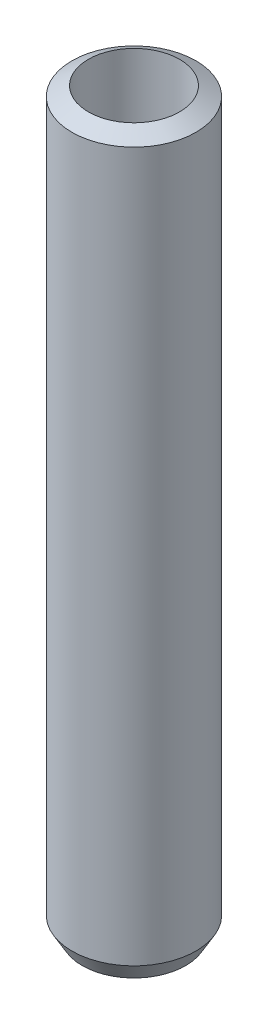
ISO-10303-21;
HEADER;
FILE_DESCRIPTION(('STEP AP214'),'2;1');
FILE_NAME('part.step','',(''),(''),'','','');
FILE_SCHEMA(('AUTOMOTIVE_DESIGN { 1 0 10303 214 1 1 1 1 }'));
ENDSEC;
DATA;
#1=APPLICATION_CONTEXT('core data for automotive mechanical design processes');
#2=APPLICATION_PROTOCOL_DEFINITION('international standard','automotive_design',2000,#1);
#3=PRODUCT_CONTEXT('',#1,'mechanical');
#4=PRODUCT('Part','Part','',(#3));
#5=PRODUCT_RELATED_PRODUCT_CATEGORY('part','',(#4));
#6=PRODUCT_DEFINITION_FORMATION('','',#4);
#7=PRODUCT_DEFINITION_CONTEXT('part definition',#1,'design');
#8=PRODUCT_DEFINITION('design','',#6,#7);
#9=PRODUCT_DEFINITION_SHAPE('','',#8);
#10=(LENGTH_UNIT() NAMED_UNIT(*) SI_UNIT(.MILLI.,.METRE.));
#11=(NAMED_UNIT(*) PLANE_ANGLE_UNIT() SI_UNIT($,.RADIAN.));
#12=(NAMED_UNIT(*) SI_UNIT($,.STERADIAN.) SOLID_ANGLE_UNIT());
#13=UNCERTAINTY_MEASURE_WITH_UNIT(LENGTH_MEASURE(1.E-05),#10,'distance_accuracy_value','');
#14=(GEOMETRIC_REPRESENTATION_CONTEXT(3) GLOBAL_UNCERTAINTY_ASSIGNED_CONTEXT((#13)) GLOBAL_UNIT_ASSIGNED_CONTEXT((#10,
#11,#12)) REPRESENTATION_CONTEXT('',''));
#15=CARTESIAN_POINT('',(0.,0.,0.));
#16=DIRECTION('',(0.,0.,1.));
#17=DIRECTION('',(1.,0.,0.));
#18=AXIS2_PLACEMENT_3D('',#15,#16,#17);
#19=CARTESIAN_POINT('',(0.,148.592827271431,0.));
#20=DIRECTION('',(0.,-1.,0.));
#21=DIRECTION('',(0.,0.,-1.));
#22=AXIS2_PLACEMENT_3D('',#19,#20,#21);
#23=CYLINDRICAL_SURFACE('',#22,12.5);
#24=CARTESIAN_POINT('',(0.,146.523268225024,0.));
#25=DIRECTION('',(0.,1.,0.));
#26=DIRECTION('',(0.,0.,1.));
#27=AXIS2_PLACEMENT_3D('',#24,#25,#26);
#28=CIRCLE('',#27,12.5);
#29=CARTESIAN_POINT('',(0.,146.523268225024,12.5));
#30=VERTEX_POINT('',#29);
#31=EDGE_CURVE('E50',#30,#30,#28,.F.);
#32=ORIENTED_EDGE('',*,*,#31,.T.);
#33=EDGE_LOOP('',(#32));
#34=FACE_BOUND('',#33,.T.);
#35=CARTESIAN_POINT('',(0.,3.58458141763965,0.));
#36=DIRECTION('',(0.,1.,0.));
#37=DIRECTION('',(0.,0.,1.));
#38=AXIS2_PLACEMENT_3D('',#35,#36,#37);
#39=CIRCLE('',#38,12.5);
#40=CARTESIAN_POINT('',(0.,3.58458141763965,12.5));
#41=VERTEX_POINT('',#40);
#42=EDGE_CURVE('E51',#41,#41,#39,.T.);
#43=ORIENTED_EDGE('',*,*,#42,.T.);
#44=EDGE_LOOP('',(#43));
#45=FACE_BOUND('',#44,.T.);
#46=ADVANCED_FACE('F39',(#34,#45),#23,.T.);
#47=CARTESIAN_POINT('',(0.,0.,0.));
#48=DIRECTION('',(0.,1.,0.));
#49=DIRECTION('',(0.,0.,1.));
#50=AXIS2_PLACEMENT_3D('',#47,#48,#49);
#51=PLANE('',#50);
#52=CARTESIAN_POINT('',(0.,0.,0.));
#53=DIRECTION('',(0.,1.,0.));
#54=DIRECTION('',(0.,0.,1.));
#55=AXIS2_PLACEMENT_3D('',#52,#53,#54);
#56=CIRCLE('',#55,10.4304409535936);
#57=CARTESIAN_POINT('',(0.,0.,10.4304409535936));
#58=VERTEX_POINT('',#57);
#59=EDGE_CURVE('E10',#58,#58,#56,.F.);
#60=ORIENTED_EDGE('',*,*,#59,.T.);
#61=EDGE_LOOP('',(#60));
#62=FACE_BOUND('',#61,.T.);
#63=CARTESIAN_POINT('',(0.,0.,0.));
#64=DIRECTION('',(0.,1.,0.));
#65=DIRECTION('',(0.,0.,1.));
#66=AXIS2_PLACEMENT_3D('',#63,#64,#65);
#67=CIRCLE('',#66,9.19227591089317);
#68=CARTESIAN_POINT('',(0.,0.,9.19227591089317));
#69=VERTEX_POINT('',#68);
#70=EDGE_CURVE('E58',#69,#69,#67,.T.);
#71=ORIENTED_EDGE('',*,*,#70,.T.);
#72=EDGE_LOOP('',(#71));
#73=FACE_BOUND('',#72,.T.);
#74=ADVANCED_FACE('F62',(#62,#73),#51,.F.);
#75=CARTESIAN_POINT('',(0.,148.592827271431,0.));
#76=DIRECTION('',(0.,-1.,0.));
#77=DIRECTION('',(0.,0.,-1.));
#78=AXIS2_PLACEMENT_3D('',#75,#76,#77);
#79=CYLINDRICAL_SURFACE('',#78,9.19227591089317);
#80=CARTESIAN_POINT('',(0.,148.432983618275,0.));
#81=DIRECTION('',(0.,-1.,0.));
#82=DIRECTION('',(0.,0.,-1.));
#83=AXIS2_PLACEMENT_3D('',#80,#81,#82);
#84=CIRCLE('',#83,9.19227591089317);
#85=CARTESIAN_POINT('',(0.,148.432983618275,-9.19227591089317));
#86=VERTEX_POINT('',#85);
#87=EDGE_CURVE('E54',#86,#86,#84,.F.);
#88=ORIENTED_EDGE('',*,*,#87,.T.);
#89=EDGE_LOOP('',(#88));
#90=FACE_BOUND('',#89,.T.);
#91=ORIENTED_EDGE('',*,*,#70,.F.);
#92=EDGE_LOOP('',(#91));
#93=FACE_BOUND('',#92,.T.);
#94=ADVANCED_FACE('F68',(#90,#93),#79,.F.);
#95=CARTESIAN_POINT('',(0.,148.592827271431,0.));
#96=DIRECTION('',(0.,-1.,0.));
#97=DIRECTION('',(0.,0.,-1.));
#98=AXIS2_PLACEMENT_3D('',#95,#96,#97);
#99=CONICAL_SURFACE('',#98,8.91541858236034,1.0471975511966);
#100=ORIENTED_EDGE('',*,*,#31,.F.);
#101=EDGE_LOOP('',(#100));
#102=FACE_BOUND('',#101,.T.);
#103=ORIENTED_EDGE('',*,*,#87,.F.);
#104=EDGE_LOOP('',(#103));
#105=FACE_BOUND('',#104,.T.);
#106=ADVANCED_FACE('F66',(#102,#105),#99,.T.);
#107=CARTESIAN_POINT('',(0.,3.58458141763965,0.));
#108=DIRECTION('',(0.,1.,0.));
#109=DIRECTION('',(0.,0.,1.));
#110=AXIS2_PLACEMENT_3D('',#107,#108,#109);
#111=CONICAL_SURFACE('',#110,12.5,0.523598775598304);
#112=CARTESIAN_POINT('',(0.,0.,10.4304409535936));
#113=CARTESIAN_POINT('',(0.,0.0373393897670794,10.451998860327));
#114=CARTESIAN_POINT('',(0.,0.0746787795341591,10.4735567670604));
#115=CARTESIAN_POINT('',(0.,0.149357559068318,10.5166725805272));
#116=CARTESIAN_POINT('',(0.,0.186696948835398,10.5382304872606));
#117=CARTESIAN_POINT('',(0.,0.261375728369557,10.5813463007274));
#118=CARTESIAN_POINT('',(0.,0.298715118136637,10.6029042074608));
#119=CARTESIAN_POINT('',(0.,0.373393897670796,10.6460200209276));
#120=CARTESIAN_POINT('',(0.,0.410733287437876,10.667577927661));
#121=CARTESIAN_POINT('',(0.,0.485412066972035,10.7106937411278));
#122=CARTESIAN_POINT('',(0.,0.522751456739115,10.7322516478612));
#123=CARTESIAN_POINT('',(0.,0.597430236273274,10.775367461328));
#124=CARTESIAN_POINT('',(0.,0.634769626040354,10.7969253680614));
#125=CARTESIAN_POINT('',(0.,0.709448405574513,10.8400411815282));
#126=CARTESIAN_POINT('',(0.,0.746787795341593,10.8615990882616));
#127=CARTESIAN_POINT('',(0.,0.821466574875752,10.9047149017284));
#128=CARTESIAN_POINT('',(0.,0.858805964642832,10.9262728084618));
#129=CARTESIAN_POINT('',(0.,0.933484744176991,10.9693886219286));
#130=CARTESIAN_POINT('',(0.,0.970824133944071,10.990946528662));
#131=CARTESIAN_POINT('',(0.,1.04550291347823,11.0340623421288));
#132=CARTESIAN_POINT('',(0.,1.08284230324531,11.0556202488622));
#133=CARTESIAN_POINT('',(0.,1.15752108277947,11.098736062329));
#134=CARTESIAN_POINT('',(0.,1.19486047254655,11.1202939690624));
#135=CARTESIAN_POINT('',(0.,1.26953925208071,11.1634097825292));
#136=CARTESIAN_POINT('',(0.,1.30687864184779,11.1849676892626));
#137=CARTESIAN_POINT('',(0.,1.38155742138195,11.2280835027294));
#138=CARTESIAN_POINT('',(0.,1.41889681114903,11.2496414094628));
#139=CARTESIAN_POINT('',(0.,1.49357559068319,11.2927572229296));
#140=CARTESIAN_POINT('',(0.,1.53091498045027,11.314315129663));
#141=CARTESIAN_POINT('',(0.,1.60559375998443,11.3574309431298));
#142=CARTESIAN_POINT('',(0.,1.64293314975151,11.3789888498632));
#143=CARTESIAN_POINT('',(0.,1.71761192928566,11.42210466333));
#144=CARTESIAN_POINT('',(0.,1.75495131905274,11.4436625700634));
#145=CARTESIAN_POINT('',(0.,1.8296300985869,11.4867783835302));
#146=CARTESIAN_POINT('',(0.,1.86696948835398,11.5083362902636));
#147=CARTESIAN_POINT('',(0.,1.94164826788814,11.5514521037304));
#148=CARTESIAN_POINT('',(0.,1.97898765765522,11.5730100104638));
#149=CARTESIAN_POINT('',(0.,2.05366643718938,11.6161258239306));
#150=CARTESIAN_POINT('',(0.,2.09100582695646,11.637683730664));
#151=CARTESIAN_POINT('',(0.,2.16568460649062,11.6807995441308));
#152=CARTESIAN_POINT('',(0.,2.2030239962577,11.7023574508642));
#153=CARTESIAN_POINT('',(0.,2.27770277579186,11.745473264331));
#154=CARTESIAN_POINT('',(0.,2.31504216555894,11.7670311710644));
#155=CARTESIAN_POINT('',(0.,2.3897209450931,11.8101469845312));
#156=CARTESIAN_POINT('',(0.,2.42706033486018,11.8317048912646));
#157=CARTESIAN_POINT('',(0.,2.50173911439434,11.8748207047314));
#158=CARTESIAN_POINT('',(0.,2.53907850416142,11.8963786114648));
#159=CARTESIAN_POINT('',(0.,2.61375728369558,11.9394944249316));
#160=CARTESIAN_POINT('',(0.,2.65109667346266,11.961052331665));
#161=CARTESIAN_POINT('',(0.,2.72577545299682,12.0041681451318));
#162=CARTESIAN_POINT('',(0.,2.7631148427639,12.0257260518652));
#163=CARTESIAN_POINT('',(0.,2.83779362229805,12.068841865332));
#164=CARTESIAN_POINT('',(0.,2.87513301206513,12.0903997720654));
#165=CARTESIAN_POINT('',(0.,2.94981179159929,12.1335155855322));
#166=CARTESIAN_POINT('',(0.,2.98715118136637,12.1550734922656));
#167=CARTESIAN_POINT('',(0.,3.06182996090053,12.1981893057324));
#168=CARTESIAN_POINT('',(0.,3.09916935066761,12.2197472124658));
#169=CARTESIAN_POINT('',(0.,3.17384813020177,12.2628630259326));
#170=CARTESIAN_POINT('',(0.,3.21118751996885,12.284420932666));
#171=CARTESIAN_POINT('',(0.,3.28586629950301,12.3275367461328));
#172=CARTESIAN_POINT('',(0.,3.32320568927009,12.3490946528662));
#173=CARTESIAN_POINT('',(0.,3.39788446880425,12.392210466333));
#174=CARTESIAN_POINT('',(0.,3.43522385857133,12.4137683730664));
#175=CARTESIAN_POINT('',(0.,3.50990263810549,12.4568841865332));
#176=CARTESIAN_POINT('',(0.,3.54724202787257,12.4784420932666));
#177=CARTESIAN_POINT('',(0.,3.58458141763965,12.5));
#178=B_SPLINE_CURVE_WITH_KNOTS('',3,(#112,#113,#114,#115,#116,#117,#118,#119,#120,#121,#122,
#123,#124,#125,#126,#127,#128,#129,#130,#131,#132,#133,#134,#135,#136,#137,#138,#139,#140,#141,
#142,#143,#144,#145,#146,#147,#148,#149,#150,#151,#152,#153,#154,#155,#156,#157,#158,#159,#160,
#161,#162,#163,#164,#165,#166,#167,#168,#169,#170,#171,#172,#173,#174,#175,#176,#177),
.UNSPECIFIED.,.F.,.F.,(4,2,2,2,2,2,2,2,2,2,2,2,2,2,2,2,2,2,2,2,2,2,2,2,2,2,2,2,2,2,2,2,4),(0.,
0.129347440400399,0.258694880800798,0.388042321201198,0.517389761601597,0.646737202001996,
0.776084642402395,0.905432082802795,1.03477952320319,1.16412696360359,1.29347440400399,
1.42282184440439,1.55216928480479,1.68151672520519,1.81086416560559,1.94021160600599,
2.06955904640639,2.19890648680679,2.32825392720719,2.45760136760759,2.58694880800798,
2.71629624840838,2.84564368880878,2.97499112920918,3.10433856960958,3.23368601000998,
3.36303345041038,3.49238089081078,3.62172833121118,3.75107577161158,3.88042321201198,
4.00977065241237,4.13911809281277),.UNSPECIFIED.);
#179=EDGE_CURVE('BSEAM45',#58,#41,#178,.T.);
#180=ORIENTED_EDGE('',*,*,#59,.F.);
#181=ORIENTED_EDGE('',*,*,#42,.F.);
#182=ORIENTED_EDGE('',*,*,#179,.T.);
#183=ORIENTED_EDGE('',*,*,#179,.F.);
#184=EDGE_LOOP('',(#180,#182,#181,#183));
#185=FACE_BOUND('',#184,.T.);
#186=ADVANCED_FACE('F45',(#185),#111,.T.);
#187=CLOSED_SHELL('',(#46,#74,#94,#106,#186));
#188=MANIFOLD_SOLID_BREP('B2',#187);
#189=ADVANCED_BREP_SHAPE_REPRESENTATION('',(#18,#188),#14);
#190=SHAPE_DEFINITION_REPRESENTATION(#9,#189);
ENDSEC;
END-ISO-10303-21;
